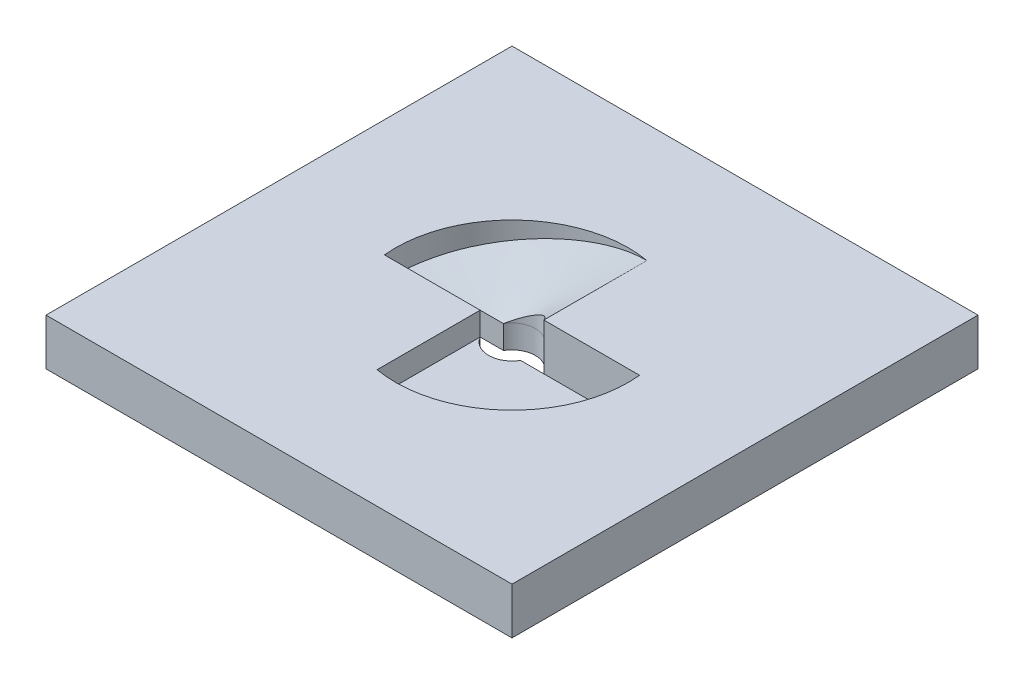
ISO-10303-21;
HEADER;
FILE_DESCRIPTION(('STEP AP214'),'2;1');
FILE_NAME('part.step','',(''),(''),'','','');
FILE_SCHEMA(('AUTOMOTIVE_DESIGN { 1 0 10303 214 1 1 1 1 }'));
ENDSEC;
DATA;
#1=APPLICATION_CONTEXT('core data for automotive mechanical design processes');
#2=APPLICATION_PROTOCOL_DEFINITION('international standard','automotive_design',2000,#1);
#3=PRODUCT_CONTEXT('',#1,'mechanical');
#4=PRODUCT('Part','Part','',(#3));
#5=PRODUCT_RELATED_PRODUCT_CATEGORY('part','',(#4));
#6=PRODUCT_DEFINITION_FORMATION('','',#4);
#7=PRODUCT_DEFINITION_CONTEXT('part definition',#1,'design');
#8=PRODUCT_DEFINITION('design','',#6,#7);
#9=PRODUCT_DEFINITION_SHAPE('','',#8);
#10=(LENGTH_UNIT() NAMED_UNIT(*) SI_UNIT(.MILLI.,.METRE.));
#11=(NAMED_UNIT(*) PLANE_ANGLE_UNIT() SI_UNIT($,.RADIAN.));
#12=(NAMED_UNIT(*) SI_UNIT($,.STERADIAN.) SOLID_ANGLE_UNIT());
#13=UNCERTAINTY_MEASURE_WITH_UNIT(LENGTH_MEASURE(1.E-05),#10,'distance_accuracy_value','');
#14=(GEOMETRIC_REPRESENTATION_CONTEXT(3) GLOBAL_UNCERTAINTY_ASSIGNED_CONTEXT((#13)) GLOBAL_UNIT_ASSIGNED_CONTEXT((#10,
#11,#12)) REPRESENTATION_CONTEXT('',''));
#15=CARTESIAN_POINT('',(0.,0.,0.));
#16=DIRECTION('',(0.,0.,1.));
#17=DIRECTION('',(1.,0.,0.));
#18=AXIS2_PLACEMENT_3D('',#15,#16,#17);
#19=CARTESIAN_POINT('',(24.8746859276655,0.,2.50000000000001));
#20=DIRECTION('',(0.,0.,1.));
#21=DIRECTION('',(1.,0.,0.));
#22=AXIS2_PLACEMENT_3D('',#19,#20,#21);
#23=PLANE('',#22);
#24=DIRECTION('',(-1.,0.,0.));
#25=VECTOR('',#24,1.);
#26=CARTESIAN_POINT('',(24.8746859276655,5.,2.50000000000001));
#27=LINE('',#26,#25);
#28=CARTESIAN_POINT('',(24.8746859276655,5.,2.50000000000001));
#29=VERTEX_POINT('',#28);
#30=CARTESIAN_POINT('',(4.33012701892221,5.,2.5));
#31=VERTEX_POINT('',#30);
#32=EDGE_CURVE('E418',#29,#31,#27,.T.);
#33=ORIENTED_EDGE('',*,*,#32,.F.);
#34=DIRECTION('',(0.,1.,0.));
#35=VECTOR('',#34,1.);
#36=CARTESIAN_POINT('',(24.8746859276655,0.,2.50000000000001));
#37=LINE('',#36,#35);
#38=CARTESIAN_POINT('',(24.8746859276655,0.,2.50000000000001));
#39=VERTEX_POINT('',#38);
#40=EDGE_CURVE('E322',#39,#29,#37,.T.);
#41=ORIENTED_EDGE('',*,*,#40,.F.);
#42=DIRECTION('',(1.,0.,0.));
#43=VECTOR('',#42,1.);
#44=CARTESIAN_POINT('',(24.8746859276655,0.,2.50000000000001));
#45=LINE('',#44,#43);
#46=CARTESIAN_POINT('',(4.33012701892221,0.,2.50000000000001));
#47=VERTEX_POINT('',#46);
#48=EDGE_CURVE('E306',#47,#39,#45,.T.);
#49=ORIENTED_EDGE('',*,*,#48,.F.);
#50=DIRECTION('',(0.,1.,0.));
#51=VECTOR('',#50,1.);
#52=CARTESIAN_POINT('',(4.33012701892221,0.,2.50000000000001));
#53=LINE('',#52,#51);
#54=EDGE_CURVE('E301',#47,#31,#53,.T.);
#55=ORIENTED_EDGE('',*,*,#54,.T.);
#56=EDGE_LOOP('',(#33,#41,#49,#55));
#57=FACE_BOUND('',#56,.T.);
#58=ADVANCED_FACE('F91',(#57),#23,.F.);
#59=CARTESIAN_POINT('',(0.,0.,0.));
#60=DIRECTION('',(0.,1.,0.));
#61=DIRECTION('',(0.,0.,1.));
#62=AXIS2_PLACEMENT_3D('',#59,#60,#61);
#63=CYLINDRICAL_SURFACE('',#62,5.);
#64=CARTESIAN_POINT('',(0.,5.,0.));
#65=DIRECTION('',(0.,1.,0.));
#66=DIRECTION('',(0.,0.,1.));
#67=AXIS2_PLACEMENT_3D('',#64,#65,#66);
#68=CIRCLE('',#67,5.);
#69=CARTESIAN_POINT('',(-4.33012701892218,5.,2.5));
#70=VERTEX_POINT('',#69);
#71=EDGE_CURVE('E14',#31,#70,#68,.F.);
#72=ORIENTED_EDGE('',*,*,#71,.F.);
#73=ORIENTED_EDGE('',*,*,#54,.F.);
#74=CARTESIAN_POINT('',(0.,0.,0.));
#75=DIRECTION('',(0.,1.,0.));
#76=DIRECTION('',(0.,0.,1.));
#77=AXIS2_PLACEMENT_3D('',#74,#75,#76);
#78=CIRCLE('',#77,5.);
#79=CARTESIAN_POINT('',(-4.33012701892218,0.,2.5));
#80=VERTEX_POINT('',#79);
#81=EDGE_CURVE('E444',#80,#47,#78,.T.);
#82=ORIENTED_EDGE('',*,*,#81,.F.);
#83=DIRECTION('',(0.,1.,0.));
#84=VECTOR('',#83,1.);
#85=CARTESIAN_POINT('',(-4.33012701892218,0.,2.5));
#86=LINE('',#85,#84);
#87=EDGE_CURVE('E295',#80,#70,#86,.T.);
#88=ORIENTED_EDGE('',*,*,#87,.T.);
#89=EDGE_LOOP('',(#72,#73,#82,#88));
#90=FACE_BOUND('',#89,.T.);
#91=ADVANCED_FACE('F264',(#90),#63,.F.);
#92=CARTESIAN_POINT('',(-4.33012701892218,0.,-2.49999999999999));
#93=DIRECTION('',(0.,0.,-1.));
#94=DIRECTION('',(-1.,0.,0.));
#95=AXIS2_PLACEMENT_3D('',#92,#93,#94);
#96=PLANE('',#95);
#97=DIRECTION('',(1.,0.,0.));
#98=VECTOR('',#97,1.);
#99=CARTESIAN_POINT('',(4.3301270189222,5.,-2.5));
#100=LINE('',#99,#98);
#101=CARTESIAN_POINT('',(-24.8746859276655,5.,-2.5));
#102=VERTEX_POINT('',#101);
#103=CARTESIAN_POINT('',(-4.33012701892218,5.,-2.5));
#104=VERTEX_POINT('',#103);
#105=EDGE_CURVE('E203',#102,#104,#100,.T.);
#106=ORIENTED_EDGE('',*,*,#105,.F.);
#107=DIRECTION('',(0.,1.,0.));
#108=VECTOR('',#107,1.);
#109=CARTESIAN_POINT('',(-24.8746859276655,0.,-2.5));
#110=LINE('',#109,#108);
#111=CARTESIAN_POINT('',(-24.8746859276655,0.,-2.5));
#112=VERTEX_POINT('',#111);
#113=EDGE_CURVE('E284',#112,#102,#110,.T.);
#114=ORIENTED_EDGE('',*,*,#113,.F.);
#115=DIRECTION('',(-1.,0.,0.));
#116=VECTOR('',#115,1.);
#117=CARTESIAN_POINT('',(-4.33012701892218,0.,-2.49999999999999));
#118=LINE('',#117,#116);
#119=CARTESIAN_POINT('',(-4.33012701892218,0.,-2.49999999999999));
#120=VERTEX_POINT('',#119);
#121=EDGE_CURVE('E435',#120,#112,#118,.T.);
#122=ORIENTED_EDGE('',*,*,#121,.F.);
#123=DIRECTION('',(0.,1.,0.));
#124=VECTOR('',#123,1.);
#125=CARTESIAN_POINT('',(-4.33012701892218,0.,-2.49999999999999));
#126=LINE('',#125,#124);
#127=EDGE_CURVE('E276',#120,#104,#126,.T.);
#128=ORIENTED_EDGE('',*,*,#127,.T.);
#129=EDGE_LOOP('',(#106,#114,#122,#128));
#130=FACE_BOUND('',#129,.T.);
#131=ADVANCED_FACE('F260',(#130),#96,.F.);
#132=CARTESIAN_POINT('',(0.,0.,0.));
#133=DIRECTION('',(0.,1.,0.));
#134=DIRECTION('',(0.,0.,1.));
#135=AXIS2_PLACEMENT_3D('',#132,#133,#134);
#136=CYLINDRICAL_SURFACE('',#135,5.);
#137=CARTESIAN_POINT('',(-4.33012701892218,5.,-2.5));
#138=CARTESIAN_POINT('',(-4.10686862484797,5.00000000000045,-2.88669488175275));
#139=CARTESIAN_POINT('',(-3.56669548423191,5.00000000000158,-3.58588976350552));
#140=CARTESIAN_POINT('',(-2.52587340980217,5.00000000000403,-4.37837918284829));
#141=CARTESIAN_POINT('',(-1.32648356103955,5.00000000000719,-4.88084744087641));
#142=CARTESIAN_POINT('',(0.,5.00000000001078,-5.05957627956178));
#143=CARTESIAN_POINT('',(1.32648356103959,5.00000000001436,-4.88084744087642));
#144=CARTESIAN_POINT('',(2.5258734098022,5.00000000001754,-4.37837918284828));
#145=CARTESIAN_POINT('',(3.56669548423195,5.00000000001996,-3.58588976350552));
#146=CARTESIAN_POINT('',(4.106868624848,5.0000000000211,-2.88669488175275));
#147=CARTESIAN_POINT('',(4.33012701892221,5.00000000002155,-2.49999999999999));
#148=B_SPLINE_CURVE_WITH_KNOTS('',3,(#137,#138,#139,#140,#141,#142,#143,#144,#145,#146,#147),
.UNSPECIFIED.,.F.,.F.,(4,1,1,1,1,1,1,1,4),(0.,0.125,0.25,0.375,0.5,0.625,0.75,0.875,1.),.UNSPECIFIED.);
#149=CARTESIAN_POINT('',(4.3301270189222,5.,-2.49999999999999));
#150=VERTEX_POINT('',#149);
#151=EDGE_CURVE('E100',#104,#150,#148,.T.);
#152=ORIENTED_EDGE('',*,*,#151,.F.);
#153=ORIENTED_EDGE('',*,*,#127,.F.);
#154=CARTESIAN_POINT('',(0.,0.,0.));
#155=DIRECTION('',(0.,1.,0.));
#156=DIRECTION('',(0.,0.,1.));
#157=AXIS2_PLACEMENT_3D('',#154,#155,#156);
#158=CIRCLE('',#157,5.);
#159=CARTESIAN_POINT('',(4.33012701892221,0.,-2.49999999999999));
#160=VERTEX_POINT('',#159);
#161=EDGE_CURVE('E432',#160,#120,#158,.T.);
#162=ORIENTED_EDGE('',*,*,#161,.F.);
#163=DIRECTION('',(0.,1.,0.));
#164=VECTOR('',#163,1.);
#165=CARTESIAN_POINT('',(4.33012701892221,0.,-2.49999999999999));
#166=LINE('',#165,#164);
#167=EDGE_CURVE('E285',#160,#150,#166,.T.);
#168=ORIENTED_EDGE('',*,*,#167,.T.);
#169=EDGE_LOOP('',(#152,#153,#162,#168));
#170=FACE_BOUND('',#169,.T.);
#171=ADVANCED_FACE('F263',(#170),#136,.F.);
#172=CARTESIAN_POINT('',(50.,10.,50.));
#173=DIRECTION('',(-1.,0.,0.));
#174=DIRECTION('',(0.,0.,1.));
#175=AXIS2_PLACEMENT_3D('',#172,#173,#174);
#176=PLANE('',#175);
#177=DIRECTION('',(0.,0.,-1.));
#178=VECTOR('',#177,1.);
#179=CARTESIAN_POINT('',(50.,0.,50.));
#180=LINE('',#179,#178);
#181=CARTESIAN_POINT('',(50.,0.,50.));
#182=VERTEX_POINT('',#181);
#183=CARTESIAN_POINT('',(50.,0.,-50.));
#184=VERTEX_POINT('',#183);
#185=EDGE_CURVE('E318',#182,#184,#180,.T.);
#186=ORIENTED_EDGE('',*,*,#185,.T.);
#187=DIRECTION('',(0.,-1.,0.));
#188=VECTOR('',#187,1.);
#189=CARTESIAN_POINT('',(50.,10.,-50.));
#190=LINE('',#189,#188);
#191=CARTESIAN_POINT('',(50.,10.,-50.));
#192=VERTEX_POINT('',#191);
#193=EDGE_CURVE('E335',#192,#184,#190,.T.);
#194=ORIENTED_EDGE('',*,*,#193,.F.);
#195=DIRECTION('',(0.,0.,-1.));
#196=VECTOR('',#195,1.);
#197=CARTESIAN_POINT('',(50.,10.,50.));
#198=LINE('',#197,#196);
#199=CARTESIAN_POINT('',(50.,10.,50.));
#200=VERTEX_POINT('',#199);
#201=EDGE_CURVE('E307',#200,#192,#198,.T.);
#202=ORIENTED_EDGE('',*,*,#201,.F.);
#203=DIRECTION('',(0.,-1.,0.));
#204=VECTOR('',#203,1.);
#205=CARTESIAN_POINT('',(50.,10.,50.));
#206=LINE('',#205,#204);
#207=EDGE_CURVE('E317',#200,#182,#206,.T.);
#208=ORIENTED_EDGE('',*,*,#207,.T.);
#209=EDGE_LOOP('',(#186,#194,#202,#208));
#210=FACE_BOUND('',#209,.T.);
#211=ADVANCED_FACE('F93',(#210),#176,.F.);
#212=CARTESIAN_POINT('',(50.,10.,-50.));
#213=DIRECTION('',(0.,0.,1.));
#214=DIRECTION('',(1.,0.,0.));
#215=AXIS2_PLACEMENT_3D('',#212,#213,#214);
#216=PLANE('',#215);
#217=DIRECTION('',(-1.,0.,0.));
#218=VECTOR('',#217,1.);
#219=CARTESIAN_POINT('',(50.,0.,-50.));
#220=LINE('',#219,#218);
#221=CARTESIAN_POINT('',(-50.,0.,-50.));
#222=VERTEX_POINT('',#221);
#223=EDGE_CURVE('E321',#184,#222,#220,.T.);
#224=ORIENTED_EDGE('',*,*,#223,.T.);
#225=DIRECTION('',(0.,-1.,0.));
#226=VECTOR('',#225,1.);
#227=CARTESIAN_POINT('',(-50.,10.,-50.));
#228=LINE('',#227,#226);
#229=CARTESIAN_POINT('',(-50.,10.,-50.));
#230=VERTEX_POINT('',#229);
#231=EDGE_CURVE('E332',#230,#222,#228,.T.);
#232=ORIENTED_EDGE('',*,*,#231,.F.);
#233=DIRECTION('',(-1.,0.,0.));
#234=VECTOR('',#233,1.);
#235=CARTESIAN_POINT('',(50.,10.,-50.));
#236=LINE('',#235,#234);
#237=EDGE_CURVE('E310',#192,#230,#236,.T.);
#238=ORIENTED_EDGE('',*,*,#237,.F.);
#239=ORIENTED_EDGE('',*,*,#193,.T.);
#240=EDGE_LOOP('',(#224,#232,#238,#239));
#241=FACE_BOUND('',#240,.T.);
#242=ADVANCED_FACE('F492',(#241),#216,.F.);
#243=CARTESIAN_POINT('',(-50.,10.,50.));
#244=DIRECTION('',(1.,0.,0.));
#245=DIRECTION('',(0.,0.,-1.));
#246=AXIS2_PLACEMENT_3D('',#243,#244,#245);
#247=PLANE('',#246);
#248=DIRECTION('',(0.,0.,1.));
#249=VECTOR('',#248,1.);
#250=CARTESIAN_POINT('',(-50.,0.,50.));
#251=LINE('',#250,#249);
#252=CARTESIAN_POINT('',(-50.,0.,50.));
#253=VERTEX_POINT('',#252);
#254=EDGE_CURVE('E324',#222,#253,#251,.T.);
#255=ORIENTED_EDGE('',*,*,#254,.T.);
#256=DIRECTION('',(0.,-1.,0.));
#257=VECTOR('',#256,1.);
#258=CARTESIAN_POINT('',(-50.,10.,50.));
#259=LINE('',#258,#257);
#260=CARTESIAN_POINT('',(-50.,10.,50.));
#261=VERTEX_POINT('',#260);
#262=EDGE_CURVE('E329',#261,#253,#259,.T.);
#263=ORIENTED_EDGE('',*,*,#262,.F.);
#264=DIRECTION('',(0.,0.,1.));
#265=VECTOR('',#264,1.);
#266=CARTESIAN_POINT('',(-50.,10.,50.));
#267=LINE('',#266,#265);
#268=EDGE_CURVE('E313',#230,#261,#267,.T.);
#269=ORIENTED_EDGE('',*,*,#268,.F.);
#270=ORIENTED_EDGE('',*,*,#231,.T.);
#271=EDGE_LOOP('',(#255,#263,#269,#270));
#272=FACE_BOUND('',#271,.T.);
#273=ADVANCED_FACE('F490',(#272),#247,.F.);
#274=CARTESIAN_POINT('',(50.,10.,50.));
#275=DIRECTION('',(0.,0.,-1.));
#276=DIRECTION('',(-1.,0.,0.));
#277=AXIS2_PLACEMENT_3D('',#274,#275,#276);
#278=PLANE('',#277);
#279=DIRECTION('',(1.,0.,0.));
#280=VECTOR('',#279,1.);
#281=CARTESIAN_POINT('',(50.,0.,50.));
#282=LINE('',#281,#280);
#283=EDGE_CURVE('E311',#253,#182,#282,.T.);
#284=ORIENTED_EDGE('',*,*,#283,.T.);
#285=ORIENTED_EDGE('',*,*,#207,.F.);
#286=DIRECTION('',(1.,0.,0.));
#287=VECTOR('',#286,1.);
#288=CARTESIAN_POINT('',(50.,10.,50.));
#289=LINE('',#288,#287);
#290=EDGE_CURVE('E315',#261,#200,#289,.T.);
#291=ORIENTED_EDGE('',*,*,#290,.F.);
#292=ORIENTED_EDGE('',*,*,#262,.T.);
#293=EDGE_LOOP('',(#284,#285,#291,#292));
#294=FACE_BOUND('',#293,.T.);
#295=ADVANCED_FACE('F486',(#294),#278,.F.);
#296=CARTESIAN_POINT('',(0.,10.,0.));
#297=DIRECTION('',(0.,1.,0.));
#298=DIRECTION('',(0.,0.,1.));
#299=AXIS2_PLACEMENT_3D('',#296,#297,#298);
#300=PLANE('',#299);
#301=CARTESIAN_POINT('',(0.,10.,0.));
#302=DIRECTION('',(0.,1.,0.));
#303=DIRECTION('',(0.,0.,1.));
#304=AXIS2_PLACEMENT_3D('',#301,#302,#303);
#305=CIRCLE('',#304,25.);
#306=CARTESIAN_POINT('',(-4.33012701892218,10.,24.6221445044903));
#307=VERTEX_POINT('',#306);
#308=CARTESIAN_POINT('',(24.8746859276655,10.,-2.49999999999999));
#309=VERTEX_POINT('',#308);
#310=EDGE_CURVE('E115',#307,#309,#305,.T.);
#311=ORIENTED_EDGE('',*,*,#310,.F.);
#312=DIRECTION('',(0.,0.,1.));
#313=VECTOR('',#312,1.);
#314=CARTESIAN_POINT('',(-4.33012701892219,10.,2.5));
#315=LINE('',#314,#313);
#316=CARTESIAN_POINT('',(-4.33012701892219,10.,2.5));
#317=VERTEX_POINT('',#316);
#318=EDGE_CURVE('E219',#317,#307,#315,.T.);
#319=ORIENTED_EDGE('',*,*,#318,.F.);
#320=DIRECTION('',(1.,0.,0.));
#321=VECTOR('',#320,1.);
#322=CARTESIAN_POINT('',(-4.33012701892218,10.,2.50000000000001));
#323=LINE('',#322,#321);
#324=CARTESIAN_POINT('',(-24.8746859276655,10.,2.50000000000001));
#325=VERTEX_POINT('',#324);
#326=EDGE_CURVE('E235',#325,#317,#323,.T.);
#327=ORIENTED_EDGE('',*,*,#326,.F.);
#328=CARTESIAN_POINT('',(0.,10.,0.));
#329=DIRECTION('',(0.,1.,0.));
#330=DIRECTION('',(0.,0.,1.));
#331=AXIS2_PLACEMENT_3D('',#328,#329,#330);
#332=CIRCLE('',#331,25.);
#333=CARTESIAN_POINT('',(4.3301270189222,10.,-24.6221445044903));
#334=VERTEX_POINT('',#333);
#335=EDGE_CURVE('E229',#334,#325,#332,.T.);
#336=ORIENTED_EDGE('',*,*,#335,.F.);
#337=DIRECTION('',(0.,0.,-1.));
#338=VECTOR('',#337,1.);
#339=CARTESIAN_POINT('',(4.3301270189222,10.,-2.5));
#340=LINE('',#339,#338);
#341=CARTESIAN_POINT('',(4.3301270189222,10.,-2.5));
#342=VERTEX_POINT('',#341);
#343=EDGE_CURVE('E200',#342,#334,#340,.T.);
#344=ORIENTED_EDGE('',*,*,#343,.F.);
#345=DIRECTION('',(-1.,0.,0.));
#346=VECTOR('',#345,1.);
#347=CARTESIAN_POINT('',(24.8746859276655,10.,-2.49999999999999));
#348=LINE('',#347,#346);
#349=EDGE_CURVE('E226',#309,#342,#348,.T.);
#350=ORIENTED_EDGE('',*,*,#349,.F.);
#351=EDGE_LOOP('',(#311,#319,#327,#336,#344,#350));
#352=FACE_BOUND('',#351,.T.);
#353=ORIENTED_EDGE('',*,*,#201,.T.);
#354=ORIENTED_EDGE('',*,*,#237,.T.);
#355=ORIENTED_EDGE('',*,*,#268,.T.);
#356=ORIENTED_EDGE('',*,*,#290,.T.);
#357=EDGE_LOOP('',(#353,#354,#355,#356));
#358=FACE_BOUND('',#357,.T.);
#359=ADVANCED_FACE('F224',(#352,#358),#300,.T.);
#360=CARTESIAN_POINT('',(0.,0.,0.));
#361=DIRECTION('',(0.,1.,0.));
#362=DIRECTION('',(0.,0.,1.));
#363=AXIS2_PLACEMENT_3D('',#360,#361,#362);
#364=PLANE('',#363);
#365=ORIENTED_EDGE('',*,*,#48,.T.);
#366=CARTESIAN_POINT('',(0.,0.,0.));
#367=DIRECTION('',(0.,1.,0.));
#368=DIRECTION('',(0.,0.,1.));
#369=AXIS2_PLACEMENT_3D('',#366,#367,#368);
#370=CIRCLE('',#369,25.);
#371=CARTESIAN_POINT('',(24.8746859276655,0.,-2.49999999999999));
#372=VERTEX_POINT('',#371);
#373=EDGE_CURVE('E426',#39,#372,#370,.T.);
#374=ORIENTED_EDGE('',*,*,#373,.T.);
#375=DIRECTION('',(-1.,0.,0.));
#376=VECTOR('',#375,1.);
#377=CARTESIAN_POINT('',(24.8746859276655,0.,-2.49999999999999));
#378=LINE('',#377,#376);
#379=EDGE_CURVE('E429',#372,#160,#378,.T.);
#380=ORIENTED_EDGE('',*,*,#379,.T.);
#381=ORIENTED_EDGE('',*,*,#161,.T.);
#382=ORIENTED_EDGE('',*,*,#121,.T.);
#383=CARTESIAN_POINT('',(0.,0.,0.));
#384=DIRECTION('',(0.,1.,0.));
#385=DIRECTION('',(0.,0.,1.));
#386=AXIS2_PLACEMENT_3D('',#383,#384,#385);
#387=CIRCLE('',#386,25.);
#388=CARTESIAN_POINT('',(-24.8746859276655,0.,2.50000000000001));
#389=VERTEX_POINT('',#388);
#390=EDGE_CURVE('E438',#112,#389,#387,.T.);
#391=ORIENTED_EDGE('',*,*,#390,.T.);
#392=DIRECTION('',(1.,0.,0.));
#393=VECTOR('',#392,1.);
#394=CARTESIAN_POINT('',(-4.33012701892218,0.,2.50000000000001));
#395=LINE('',#394,#393);
#396=EDGE_CURVE('E441',#389,#80,#395,.T.);
#397=ORIENTED_EDGE('',*,*,#396,.T.);
#398=ORIENTED_EDGE('',*,*,#81,.T.);
#399=EDGE_LOOP('',(#365,#374,#380,#381,#382,#391,#397,#398));
#400=FACE_BOUND('',#399,.T.);
#401=ORIENTED_EDGE('',*,*,#185,.F.);
#402=ORIENTED_EDGE('',*,*,#283,.F.);
#403=ORIENTED_EDGE('',*,*,#254,.F.);
#404=ORIENTED_EDGE('',*,*,#223,.F.);
#405=EDGE_LOOP('',(#401,#402,#403,#404));
#406=FACE_BOUND('',#405,.T.);
#407=ADVANCED_FACE('F466',(#400,#406),#364,.F.);
#408=CARTESIAN_POINT('',(0.,0.,0.));
#409=DIRECTION('',(0.,1.,0.));
#410=DIRECTION('',(0.,0.,1.));
#411=AXIS2_PLACEMENT_3D('',#408,#409,#410);
#412=CYLINDRICAL_SURFACE('',#411,25.);
#413=ORIENTED_EDGE('',*,*,#310,.T.);
#414=DIRECTION('',(0.,1.,0.));
#415=VECTOR('',#414,1.);
#416=CARTESIAN_POINT('',(24.8746859276655,0.,-2.49999999999999));
#417=LINE('',#416,#415);
#418=EDGE_CURVE('E234',#372,#309,#417,.T.);
#419=ORIENTED_EDGE('',*,*,#418,.F.);
#420=ORIENTED_EDGE('',*,*,#373,.F.);
#421=ORIENTED_EDGE('',*,*,#40,.T.);
#422=CARTESIAN_POINT('',(0.,5.,0.));
#423=DIRECTION('',(0.,1.,0.));
#424=DIRECTION('',(0.,0.,1.));
#425=AXIS2_PLACEMENT_3D('',#422,#423,#424);
#426=CIRCLE('',#425,25.);
#427=CARTESIAN_POINT('',(-4.33012701892218,5.,24.6221445044903));
#428=VERTEX_POINT('',#427);
#429=EDGE_CURVE('E416',#428,#29,#426,.T.);
#430=ORIENTED_EDGE('',*,*,#429,.F.);
#431=DIRECTION('',(0.,1.,0.));
#432=VECTOR('',#431,1.);
#433=CARTESIAN_POINT('',(-4.33012701892218,5.,24.6221445044903));
#434=LINE('',#433,#432);
#435=EDGE_CURVE('E237',#428,#307,#434,.T.);
#436=ORIENTED_EDGE('',*,*,#435,.T.);
#437=EDGE_LOOP('',(#413,#419,#420,#421,#430,#436));
#438=FACE_BOUND('',#437,.T.);
#439=ADVANCED_FACE('F463',(#438),#412,.F.);
#440=CARTESIAN_POINT('',(-4.33012701892218,0.,2.50000000000001));
#441=DIRECTION('',(0.,0.,1.));
#442=DIRECTION('',(1.,0.,0.));
#443=AXIS2_PLACEMENT_3D('',#440,#441,#442);
#444=PLANE('',#443);
#445=ORIENTED_EDGE('',*,*,#326,.T.);
#446=DIRECTION('',(0.,1.,0.));
#447=VECTOR('',#446,1.);
#448=CARTESIAN_POINT('',(-4.33012701892219,5.,2.5));
#449=LINE('',#448,#447);
#450=EDGE_CURVE('E421',#70,#317,#449,.T.);
#451=ORIENTED_EDGE('',*,*,#450,.F.);
#452=ORIENTED_EDGE('',*,*,#87,.F.);
#453=ORIENTED_EDGE('',*,*,#396,.F.);
#454=DIRECTION('',(0.,1.,0.));
#455=VECTOR('',#454,1.);
#456=CARTESIAN_POINT('',(-24.8746859276655,0.,2.50000000000001));
#457=LINE('',#456,#455);
#458=EDGE_CURVE('E292',#389,#325,#457,.T.);
#459=ORIENTED_EDGE('',*,*,#458,.T.);
#460=EDGE_LOOP('',(#445,#451,#452,#453,#459));
#461=FACE_BOUND('',#460,.T.);
#462=ADVANCED_FACE('F257',(#461),#444,.F.);
#463=CARTESIAN_POINT('',(0.,0.,0.));
#464=DIRECTION('',(0.,1.,0.));
#465=DIRECTION('',(0.,0.,1.));
#466=AXIS2_PLACEMENT_3D('',#463,#464,#465);
#467=CYLINDRICAL_SURFACE('',#466,25.);
#468=ORIENTED_EDGE('',*,*,#113,.T.);
#469=CARTESIAN_POINT('',(4.3301270189222,10.,-24.6221445044903));
#470=CARTESIAN_POINT('',(2.82663509649614,9.74259518025748,-24.886553276636));
#471=CARTESIAN_POINT('',(-0.358952696737439,9.19720771294867,-25.1532733103853));
#472=CARTESIAN_POINT('',(-4.5841491536391,8.47383440036671,-24.6872392078868));
#473=CARTESIAN_POINT('',(-9.66035710795584,7.60476395577931,-23.26802118492));
#474=CARTESIAN_POINT('',(-13.3334110567214,6.97592001223423,-21.3589472546123));
#475=CARTESIAN_POINT('',(-16.2555502388777,6.47563617417291,-19.0126045204901));
#476=CARTESIAN_POINT('',(-17.2611475825189,6.30347322529866,-18.0967653814293));
#477=CARTESIAN_POINT('',(-18.21297445407,6.14051603168611,-17.1313302960852));
#478=CARTESIAN_POINT('',(-19.9414006828902,5.84460141104101,-15.206842326026));
#479=CARTESIAN_POINT('',(-23.2103650364307,5.28493948827521,-10.4100389003058));
#480=CARTESIAN_POINT('',(-24.5693729761166,5.0522709993225,-5.53782551177134));
#481=CARTESIAN_POINT('',(-24.8746859276655,5.,-2.49999999999999));
#482=B_SPLINE_CURVE_WITH_KNOTS('',3,(#469,#470,#471,#472,#473,#474,#475,#476,#477,#478,#479,
#480,#481),.UNSPECIFIED.,.F.,.F.,(4,1,1,1,1,1,1,1,1,1,4),(0.,0.125,0.25,0.3125,0.5,0.53125,
0.570529247148241,0.59375,0.625,0.75,1.),.UNSPECIFIED.);
#483=EDGE_CURVE('E351',#102,#334,#482,.F.);
#484=ORIENTED_EDGE('',*,*,#483,.T.);
#485=ORIENTED_EDGE('',*,*,#335,.T.);
#486=ORIENTED_EDGE('',*,*,#458,.F.);
#487=ORIENTED_EDGE('',*,*,#390,.F.);
#488=EDGE_LOOP('',(#468,#484,#485,#486,#487));
#489=FACE_BOUND('',#488,.T.);
#490=ADVANCED_FACE('F247',(#489),#467,.F.);
#491=CARTESIAN_POINT('',(24.8746859276655,0.,-2.49999999999999));
#492=DIRECTION('',(0.,0.,-1.));
#493=DIRECTION('',(-1.,0.,0.));
#494=AXIS2_PLACEMENT_3D('',#491,#492,#493);
#495=PLANE('',#494);
#496=ORIENTED_EDGE('',*,*,#349,.T.);
#497=DIRECTION('',(0.,1.,0.));
#498=VECTOR('',#497,1.);
#499=CARTESIAN_POINT('',(4.3301270189222,5.,-2.5));
#500=LINE('',#499,#498);
#501=EDGE_CURVE('E211',#150,#342,#500,.T.);
#502=ORIENTED_EDGE('',*,*,#501,.F.);
#503=ORIENTED_EDGE('',*,*,#167,.F.);
#504=ORIENTED_EDGE('',*,*,#379,.F.);
#505=ORIENTED_EDGE('',*,*,#418,.T.);
#506=EDGE_LOOP('',(#496,#502,#503,#504,#505));
#507=FACE_BOUND('',#506,.T.);
#508=ADVANCED_FACE('F232',(#507),#495,.F.);
#509=CARTESIAN_POINT('',(0.,5.,0.));
#510=DIRECTION('',(0.,1.,0.));
#511=DIRECTION('',(0.,0.,1.));
#512=AXIS2_PLACEMENT_3D('',#509,#510,#511);
#513=PLANE('',#512);
#514=ORIENTED_EDGE('',*,*,#71,.T.);
#515=DIRECTION('',(0.,0.,1.));
#516=VECTOR('',#515,1.);
#517=CARTESIAN_POINT('',(-4.33012701892219,5.,2.5));
#518=LINE('',#517,#516);
#519=EDGE_CURVE('E108',#70,#428,#518,.T.);
#520=ORIENTED_EDGE('',*,*,#519,.T.);
#521=ORIENTED_EDGE('',*,*,#429,.T.);
#522=ORIENTED_EDGE('',*,*,#32,.T.);
#523=EDGE_LOOP('',(#514,#520,#521,#522));
#524=FACE_BOUND('',#523,.T.);
#525=ADVANCED_FACE('F460',(#524),#513,.T.);
#526=CARTESIAN_POINT('',(-4.33012701892219,5.,2.5));
#527=DIRECTION('',(-1.,0.,0.));
#528=DIRECTION('',(0.,0.,1.));
#529=AXIS2_PLACEMENT_3D('',#526,#527,#528);
#530=PLANE('',#529);
#531=ORIENTED_EDGE('',*,*,#318,.T.);
#532=ORIENTED_EDGE('',*,*,#435,.F.);
#533=ORIENTED_EDGE('',*,*,#519,.F.);
#534=ORIENTED_EDGE('',*,*,#450,.T.);
#535=EDGE_LOOP('',(#531,#532,#533,#534));
#536=FACE_BOUND('',#535,.T.);
#537=ADVANCED_FACE('F392',(#536),#530,.F.);
#538=CARTESIAN_POINT('',(4.3301270189222,10.,-24.6221445044903));
#539=CARTESIAN_POINT('',(2.82663509649614,9.74259518025748,-24.886553276636));
#540=CARTESIAN_POINT('',(-0.358952696737439,9.19720771294867,-25.1532733103853));
#541=CARTESIAN_POINT('',(-4.5841491536391,8.47383440036671,-24.6872392078868));
#542=CARTESIAN_POINT('',(-9.66035710795584,7.60476395577931,-23.26802118492));
#543=CARTESIAN_POINT('',(-13.3334110567214,6.97592001223423,-21.3589472546123));
#544=CARTESIAN_POINT('',(-16.2555502388777,6.47563617417291,-19.0126045204901));
#545=CARTESIAN_POINT('',(-17.2611475825189,6.30347322529866,-18.0967653814293));
#546=CARTESIAN_POINT('',(-18.21297445407,6.14051603168611,-17.1313302960852));
#547=CARTESIAN_POINT('',(-19.9414006828902,5.84460141104101,-15.206842326026));
#548=CARTESIAN_POINT('',(-23.2103650364307,5.28493948827521,-10.4100389003058));
#549=CARTESIAN_POINT('',(-24.5693729761166,5.0522709993225,-5.53782551177134));
#550=CARTESIAN_POINT('',(-24.8746859276655,5.,-2.49999999999999));
#551=CARTESIAN_POINT('',(4.3301270189222,10.,-17.2480963363268));
#552=CARTESIAN_POINT('',(3.22319579353045,9.76800405664207,-17.6055470416794));
#553=CARTESIAN_POINT('',(0.773258937821199,9.21607402192862,-18.1762323095136));
#554=CARTESIAN_POINT('',(-2.71213145588066,8.3478129393534,-18.1236235591227));
#555=CARTESIAN_POINT('',(-6.84569577564948,7.33575152282219,-17.1874633653568));
#556=CARTESIAN_POINT('',(-9.71150190982415,6.67570740815962,-15.7096089439408));
#557=CARTESIAN_POINT('',(-11.9059613307628,6.19994500766578,-13.9559111595206));
#558=CARTESIAN_POINT('',(-12.6585663839056,6.03770757642255,-13.2697020594962));
#559=CARTESIAN_POINT('',(-13.3521355402333,5.89499544191473,-12.5669362982493));
#560=CARTESIAN_POINT('',(-14.5622257984702,5.66434465747034,-11.2204993652008));
#561=CARTESIAN_POINT('',(-16.834390387036,5.23762683843351,-7.90756166824595));
#562=CARTESIAN_POINT('',(-17.7916732061018,5.05290941905908,-4.57940326637981));
#563=CARTESIAN_POINT('',(-18.0264996247511,5.,-2.5));
#564=CARTESIAN_POINT('',(4.3301270189222,10.,-9.87404816816342));
#565=CARTESIAN_POINT('',(3.61975649056477,9.79341293302666,-10.3245408067228));
#566=CARTESIAN_POINT('',(1.90547057237984,9.23494033090856,-11.199191308642));
#567=CARTESIAN_POINT('',(-0.840113758122207,8.2217914783401,-11.5600079103586));
#568=CARTESIAN_POINT('',(-4.03103444334312,7.06673908986506,-11.1069055457935));
#569=CARTESIAN_POINT('',(-6.08959276292693,6.37549480408501,-10.0602706332693));
#570=CARTESIAN_POINT('',(-7.55637242264793,5.92425384115864,-8.89921779855109));
#571=CARTESIAN_POINT('',(-8.05598518529233,5.77194192754643,-8.44263873756317));
#572=CARTESIAN_POINT('',(-8.49129662639662,5.64947485214335,-8.00254230041345));
#573=CARTESIAN_POINT('',(-9.18305091405024,5.48408790389967,-7.23415640437562));
#574=CARTESIAN_POINT('',(-10.4584157376413,5.19031418859182,-5.40508443618614));
#575=CARTESIAN_POINT('',(-11.013973436087,5.05354783879567,-3.62098102098829));
#576=CARTESIAN_POINT('',(-11.1783133218366,5.,-2.5));
#577=CARTESIAN_POINT('',(4.3301270189222,10.,-2.5));
#578=CARTESIAN_POINT('',(4.01631718759909,9.81882180941125,-3.04353457176625));
#579=CARTESIAN_POINT('',(3.03768220693848,9.25380663988851,-4.22215030777035));
#580=CARTESIAN_POINT('',(1.03190393963624,8.0957700173268,-4.99639226159446));
#581=CARTESIAN_POINT('',(-1.21637311103677,6.79772665690793,-5.0263477262302));
#582=CARTESIAN_POINT('',(-2.4676836160297,6.0752822000104,-4.41093232259772));
#583=CARTESIAN_POINT('',(-3.20678351453303,5.6485626746515,-3.84252443758157));
#584=CARTESIAN_POINT('',(-3.45340398667905,5.50617627867032,-3.61557541563011));
#585=CARTESIAN_POINT('',(-3.63045771255993,5.40395426237197,-3.4381483025776));
#586=CARTESIAN_POINT('',(-3.80387602963027,5.30383115032899,-3.24781344355045));
#587=CARTESIAN_POINT('',(-4.0824410882466,5.14300153875012,-2.90260720412634));
#588=CARTESIAN_POINT('',(-4.23627366607225,5.05418625853225,-2.66255877559676));
#589=CARTESIAN_POINT('',(-4.33012701892218,5.,-2.5));
#590=B_SPLINE_SURFACE_WITH_KNOTS('',3,3,((#538,#539,#540,#541,#542,#543,#544,#545,#546,#547,
#548,#549,#550),(#551,#552,#553,#554,#555,#556,#557,#558,#559,#560,#561,#562,#563),(#564,#565,
#566,#567,#568,#569,#570,#571,#572,#573,#574,#575,#576),(#577,#578,#579,#580,#581,#582,#583,
#584,#585,#586,#587,#588,#589)),.UNSPECIFIED.,.F.,.F.,.F.,(4,4),(4,1,1,1,1,1,1,1,1,1,4),(0.,1.),
(0.,0.125,0.25,0.3125,0.5,0.53125,0.570529247148241,0.59375,0.625,0.75,1.),.UNSPECIFIED.);
#591=CARTESIAN_POINT('',(-4.33012701892218,5.,-2.5));
#592=CARTESIAN_POINT('',(-4.23627366607225,5.05418625853225,-2.66255877559676));
#593=CARTESIAN_POINT('',(-4.0824410882466,5.14300153875012,-2.90260720412634));
#594=CARTESIAN_POINT('',(-3.80387602963027,5.30383115032899,-3.24781344355045));
#595=CARTESIAN_POINT('',(-3.63045771255993,5.40395426237197,-3.4381483025776));
#596=CARTESIAN_POINT('',(-3.45340398667905,5.50617627867032,-3.61557541563011));
#597=CARTESIAN_POINT('',(-3.20678351453303,5.6485626746515,-3.84252443758157));
#598=CARTESIAN_POINT('',(-2.4676836160297,6.0752822000104,-4.41093232259772));
#599=CARTESIAN_POINT('',(-1.21637311103677,6.79772665690793,-5.0263477262302));
#600=CARTESIAN_POINT('',(1.03190393963624,8.0957700173268,-4.99639226159446));
#601=CARTESIAN_POINT('',(3.03768220693848,9.25380663988851,-4.22215030777035));
#602=CARTESIAN_POINT('',(4.01631718759909,9.81882180941125,-3.04353457176625));
#603=CARTESIAN_POINT('',(4.3301270189222,10.,-2.5));
#604=B_SPLINE_CURVE_WITH_KNOTS('',3,(#591,#592,#593,#594,#595,#596,#597,#598,#599,#600,#601,
#602,#603),.UNSPECIFIED.,.F.,.F.,(4,1,1,1,1,1,1,1,1,1,4),(0.,0.25,0.375,0.40625,
0.429470752851759,0.46875,0.5,0.6875,0.75,0.875,1.),.UNSPECIFIED.);
#605=EDGE_CURVE('E195',#104,#342,#604,.T.);
#606=ORIENTED_EDGE('',*,*,#343,.T.);
#607=ORIENTED_EDGE('',*,*,#483,.F.);
#608=ORIENTED_EDGE('',*,*,#105,.T.);
#609=ORIENTED_EDGE('',*,*,#605,.T.);
#610=EDGE_LOOP('',(#606,#607,#608,#609));
#611=FACE_BOUND('',#610,.T.);
#612=ADVANCED_FACE('F198',(#611),#590,.F.);
#613=CARTESIAN_POINT('',(4.33012701892221,5.,-2.49999999999999));
#614=CARTESIAN_POINT('',(4.33012701892221,6.66666666666667,-2.49999999999999));
#615=CARTESIAN_POINT('',(4.3301270189222,8.33333333333333,-2.5));
#616=CARTESIAN_POINT('',(4.3301270189222,10.,-2.5));
#617=CARTESIAN_POINT('',(4.10686862484782,5.,-2.88669488175307));
#618=CARTESIAN_POINT('',(4.12114743649869,6.63194444444444,-2.86196325450205));
#619=CARTESIAN_POINT('',(4.13542624814957,8.26388888888889,-2.83723162725102));
#620=CARTESIAN_POINT('',(4.14970505980044,9.89583333333333,-2.8125));
#621=CARTESIAN_POINT('',(3.5666954842314,5.,-3.58588976350615));
#622=CARTESIAN_POINT('',(3.60886498560007,6.5440907722796,-3.53724165098434));
#623=CARTESIAN_POINT('',(3.65103448696873,8.0881815445592,-3.48859353846252));
#624=CARTESIAN_POINT('',(3.69320398833739,9.6322723168388,-3.43994542594071));
#625=CARTESIAN_POINT('',(2.52587340980139,5.00000000000001,-4.37837918284873));
#626=CARTESIAN_POINT('',(2.58845710841135,6.35557061293526,-4.34329464639623));
#627=CARTESIAN_POINT('',(2.6510408070213,7.7111412258705,-4.30821010994373));
#628=CARTESIAN_POINT('',(2.71362450563126,9.06671183880575,-4.27312557349122));
#629=CARTESIAN_POINT('',(1.3264835610391,5.,-4.88084744087654));
#630=CARTESIAN_POINT('',(1.36400674874672,6.11027923620436,-4.87160091905812));
#631=CARTESIAN_POINT('',(1.40152993645433,7.22055847240872,-4.8623543972397));
#632=CARTESIAN_POINT('',(1.43905312416195,8.33083770861308,-4.85310787542128));
#633=CARTESIAN_POINT('',(0.,5.00000000000001,-5.05957627956172));
#634=CARTESIAN_POINT('',(0.,5.83333333333333,-5.06409635277514));
#635=CARTESIAN_POINT('',(0.,6.66666666666666,-5.06861642598856));
#636=CARTESIAN_POINT('',(0.,7.49999999999998,-5.07313649920197));
#637=CARTESIAN_POINT('',(-1.32648356103906,5.,-4.88084744087653));
#638=CARTESIAN_POINT('',(-1.36400674874669,5.55638743046231,-4.87160091905811));
#639=CARTESIAN_POINT('',(-1.40152993645431,6.11277486092463,-4.86235439723969));
#640=CARTESIAN_POINT('',(-1.43905312416193,6.66916229138695,-4.85310787542127));
#641=CARTESIAN_POINT('',(-2.52587340980136,5.00000000000001,-4.37837918284874));
#642=CARTESIAN_POINT('',(-2.58845710841132,5.31109605373141,-4.34329464639623));
#643=CARTESIAN_POINT('',(-2.65104080702128,5.62219210746281,-4.30821010994372));
#644=CARTESIAN_POINT('',(-2.71362450563124,5.93328816119422,-4.27312557349121));
#645=CARTESIAN_POINT('',(-3.56669548423137,4.99999999999999,-3.58588976350615));
#646=CARTESIAN_POINT('',(-3.60886498560004,5.12257589438707,-3.53724165098434));
#647=CARTESIAN_POINT('',(-3.6510344869687,5.24515178877414,-3.48859353846252));
#648=CARTESIAN_POINT('',(-3.69320398833737,5.36772768316122,-3.43994542594071));
#649=CARTESIAN_POINT('',(-4.10686862484779,5.,-2.88669488175307));
#650=CARTESIAN_POINT('',(-4.12114743649867,5.03472222222222,-2.86196325450205));
#651=CARTESIAN_POINT('',(-4.13542624814954,5.06944444444444,-2.83723162725102));
#652=CARTESIAN_POINT('',(-4.14970505980042,5.10416666666667,-2.81249999999999));
#653=CARTESIAN_POINT('',(-4.33012701892218,5.,-2.5));
#654=CARTESIAN_POINT('',(-4.33012701892218,5.,-2.49999999999999));
#655=CARTESIAN_POINT('',(-4.33012701892218,5.,-2.49999999999999));
#656=CARTESIAN_POINT('',(-4.33012701892218,5.,-2.49999999999999));
#657=B_SPLINE_SURFACE_WITH_KNOTS('',3,3,((#613,#614,#615,#616),(#617,#618,#619,#620),(#621,#622,
#623,#624),(#625,#626,#627,#628),(#629,#630,#631,#632),(#633,#634,#635,#636),(#637,#638,#639,
#640),(#641,#642,#643,#644),(#645,#646,#647,#648),(#649,#650,#651,#652),(#653,#654,#655,#656)),
.UNSPECIFIED.,.F.,.F.,.F.,(4,1,1,1,1,1,1,1,4),(4,4),(0.,0.125,0.25,0.375,0.5,0.625,0.75,0.875,
1.),(0.,1.),.UNSPECIFIED.);
#658=ORIENTED_EDGE('',*,*,#151,.T.);
#659=ORIENTED_EDGE('',*,*,#501,.T.);
#660=ORIENTED_EDGE('',*,*,#605,.F.);
#661=EDGE_LOOP('',(#658,#659,#660));
#662=FACE_BOUND('',#661,.T.);
#663=ADVANCED_FACE('F212',(#662),#657,.F.);
#664=CLOSED_SHELL('',(#58,#91,#131,#171,#211,#242,#273,#295,#359,#407,#439,#462,#490,#508,#525,
#537,#612,#663));
#665=MANIFOLD_SOLID_BREP('B2',#664);
#666=ADVANCED_BREP_SHAPE_REPRESENTATION('',(#18,#665),#14);
#667=SHAPE_DEFINITION_REPRESENTATION(#9,#666);
ENDSEC;
END-ISO-10303-21;
